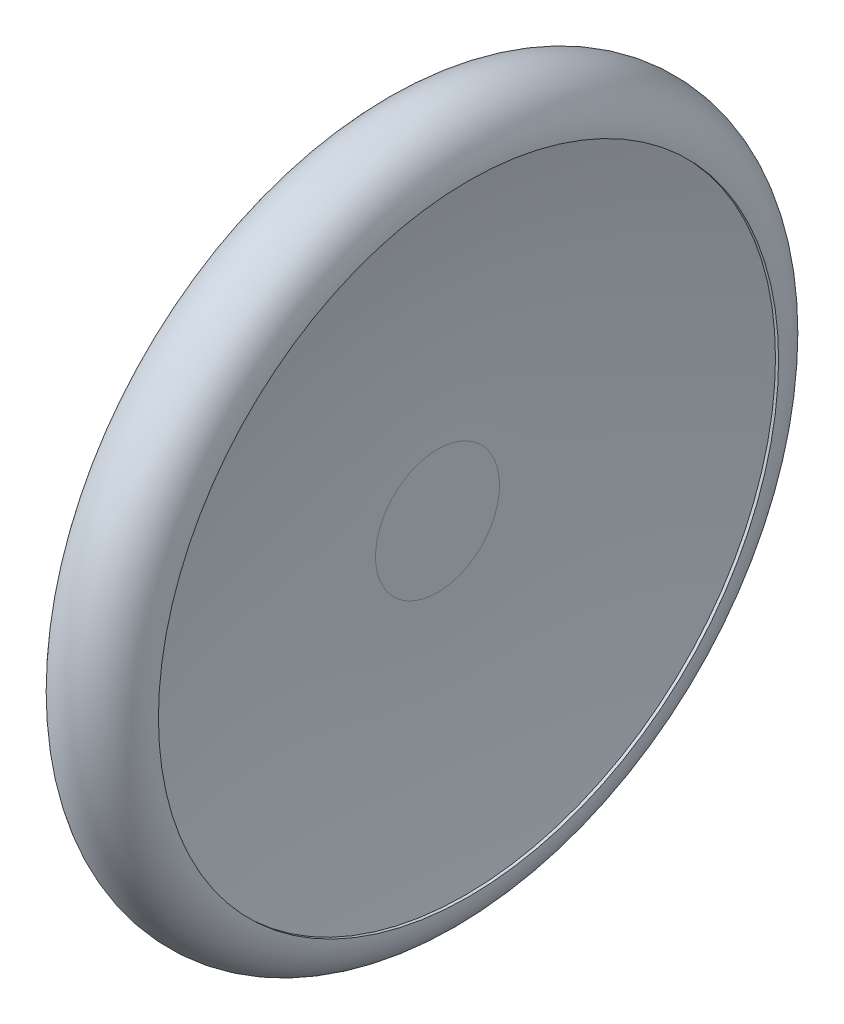
ISO-10303-21;
HEADER;
FILE_DESCRIPTION(('STEP AP214'),'2;1');
FILE_NAME('part.step','',(''),(''),'','','');
FILE_SCHEMA(('AUTOMOTIVE_DESIGN { 1 0 10303 214 1 1 1 1 }'));
ENDSEC;
DATA;
#1=APPLICATION_CONTEXT('core data for automotive mechanical design processes');
#2=APPLICATION_PROTOCOL_DEFINITION('international standard','automotive_design',2000,#1);
#3=PRODUCT_CONTEXT('',#1,'mechanical');
#4=PRODUCT('Part','Part','',(#3));
#5=PRODUCT_RELATED_PRODUCT_CATEGORY('part','',(#4));
#6=PRODUCT_DEFINITION_FORMATION('','',#4);
#7=PRODUCT_DEFINITION_CONTEXT('part definition',#1,'design');
#8=PRODUCT_DEFINITION('design','',#6,#7);
#9=PRODUCT_DEFINITION_SHAPE('','',#8);
#10=(LENGTH_UNIT() NAMED_UNIT(*) SI_UNIT(.MILLI.,.METRE.));
#11=(NAMED_UNIT(*) PLANE_ANGLE_UNIT() SI_UNIT($,.RADIAN.));
#12=(NAMED_UNIT(*) SI_UNIT($,.STERADIAN.) SOLID_ANGLE_UNIT());
#13=UNCERTAINTY_MEASURE_WITH_UNIT(LENGTH_MEASURE(1.E-05),#10,'distance_accuracy_value','');
#14=(GEOMETRIC_REPRESENTATION_CONTEXT(3) GLOBAL_UNCERTAINTY_ASSIGNED_CONTEXT((#13)) GLOBAL_UNIT_ASSIGNED_CONTEXT((#10,
#11,#12)) REPRESENTATION_CONTEXT('',''));
#15=CARTESIAN_POINT('',(0.,0.,0.));
#16=DIRECTION('',(0.,0.,1.));
#17=DIRECTION('',(1.,0.,0.));
#18=AXIS2_PLACEMENT_3D('',#15,#16,#17);
#19=CARTESIAN_POINT('',(-5.,0.,0.));
#20=DIRECTION('',(1.,0.,0.));
#21=DIRECTION('',(0.,0.,-1.));
#22=AXIS2_PLACEMENT_3D('',#19,#20,#21);
#23=PLANE('',#22);
#24=CARTESIAN_POINT('',(-5.,0.,0.));
#25=DIRECTION('',(1.,0.,0.));
#26=DIRECTION('',(0.,0.,-1.));
#27=AXIS2_PLACEMENT_3D('',#24,#25,#26);
#28=CIRCLE('',#27,10.);
#29=CARTESIAN_POINT('',(-5.,0.,-10.));
#30=VERTEX_POINT('',#29);
#31=EDGE_CURVE('E10',#30,#30,#28,.F.);
#32=ORIENTED_EDGE('',*,*,#31,.F.);
#33=EDGE_LOOP('',(#32));
#34=FACE_BOUND('',#33,.T.);
#35=CARTESIAN_POINT('',(-5.,0.,0.));
#36=DIRECTION('',(-1.,0.,0.));
#37=DIRECTION('',(0.,0.,1.));
#38=AXIS2_PLACEMENT_3D('',#35,#36,#37);
#39=CIRCLE('',#38,50.);
#40=CARTESIAN_POINT('',(-5.,0.,50.));
#41=VERTEX_POINT('',#40);
#42=EDGE_CURVE('E57',#41,#41,#39,.T.);
#43=ORIENTED_EDGE('',*,*,#42,.T.);
#44=EDGE_LOOP('',(#43));
#45=FACE_BOUND('',#44,.T.);
#46=ADVANCED_FACE('F38',(#34,#45),#23,.F.);
#47=CARTESIAN_POINT('',(5.,0.,0.));
#48=DIRECTION('',(-1.,0.,0.));
#49=DIRECTION('',(0.,0.,1.));
#50=AXIS2_PLACEMENT_3D('',#47,#48,#49);
#51=PLANE('',#50);
#52=CARTESIAN_POINT('',(5.,0.,0.));
#53=DIRECTION('',(-1.,0.,0.));
#54=DIRECTION('',(0.,0.,1.));
#55=AXIS2_PLACEMENT_3D('',#52,#53,#54);
#56=CIRCLE('',#55,10.);
#57=CARTESIAN_POINT('',(5.,0.,10.));
#58=VERTEX_POINT('',#57);
#59=EDGE_CURVE('E44',#58,#58,#56,.T.);
#60=ORIENTED_EDGE('',*,*,#59,.F.);
#61=EDGE_LOOP('',(#60));
#62=FACE_BOUND('',#61,.T.);
#63=ADVANCED_FACE('F79',(#62),#51,.F.);
#64=CARTESIAN_POINT('',(185.027777777778,0.,0.));
#65=DIRECTION('',(-1.,0.,0.));
#66=DIRECTION('',(0.,0.,1.));
#67=AXIS2_PLACEMENT_3D('',#64,#65,#66);
#68=DEGENERATE_TOROIDAL_SURFACE('',#67,10.,180.027777777778,.T.);
#69=CARTESIAN_POINT('',(9.5,0.,0.));
#70=DIRECTION('',(-1.,0.,0.));
#71=DIRECTION('',(0.,0.,1.));
#72=AXIS2_PLACEMENT_3D('',#69,#70,#71);
#73=CIRCLE('',#72,50.);
#74=CARTESIAN_POINT('',(9.5,0.,50.));
#75=VERTEX_POINT('',#74);
#76=EDGE_CURVE('E48',#75,#75,#73,.T.);
#77=ORIENTED_EDGE('',*,*,#76,.F.);
#78=EDGE_LOOP('',(#77));
#79=FACE_BOUND('',#78,.T.);
#80=ORIENTED_EDGE('',*,*,#59,.T.);
#81=EDGE_LOOP('',(#80));
#82=FACE_BOUND('',#81,.T.);
#83=ADVANCED_FACE('F84',(#79,#82),#68,.F.);
#84=CARTESIAN_POINT('',(-5.,0.,0.));
#85=DIRECTION('',(-1.,0.,0.));
#86=DIRECTION('',(0.,0.,1.));
#87=AXIS2_PLACEMENT_3D('',#84,#85,#86);
#88=CYLINDRICAL_SURFACE('',#87,50.);
#89=CARTESIAN_POINT('',(10.,0.,0.));
#90=DIRECTION('',(-1.,0.,0.));
#91=DIRECTION('',(0.,0.,1.));
#92=AXIS2_PLACEMENT_3D('',#89,#90,#91);
#93=CIRCLE('',#92,50.);
#94=CARTESIAN_POINT('',(10.,0.,50.));
#95=VERTEX_POINT('',#94);
#96=EDGE_CURVE('E52',#95,#95,#93,.T.);
#97=ORIENTED_EDGE('',*,*,#96,.F.);
#98=EDGE_LOOP('',(#97));
#99=FACE_BOUND('',#98,.T.);
#100=ORIENTED_EDGE('',*,*,#76,.T.);
#101=EDGE_LOOP('',(#100));
#102=FACE_BOUND('',#101,.T.);
#103=ADVANCED_FACE('F75',(#99,#102),#88,.F.);
#104=CARTESIAN_POINT('',(2.5,0.,0.));
#105=DIRECTION('',(-1.,0.,0.));
#106=DIRECTION('',(0.,0.,1.));
#107=AXIS2_PLACEMENT_3D('',#104,#105,#106);
#108=TOROIDAL_SURFACE('',#107,50.,7.5);
#109=ORIENTED_EDGE('',*,*,#42,.F.);
#110=EDGE_LOOP('',(#109));
#111=FACE_BOUND('',#110,.T.);
#112=ORIENTED_EDGE('',*,*,#96,.T.);
#113=EDGE_LOOP('',(#112));
#114=FACE_BOUND('',#113,.T.);
#115=ADVANCED_FACE('F68',(#111,#114),#108,.T.);
#116=CARTESIAN_POINT('',(-15.,0.,0.));
#117=DIRECTION('',(1.,0.,0.));
#118=DIRECTION('',(0.,0.,-1.));
#119=AXIS2_PLACEMENT_3D('',#116,#117,#118);
#120=CYLINDRICAL_SURFACE('',#119,10.);
#121=CARTESIAN_POINT('',(-15.,0.,0.));
#122=DIRECTION('',(-1.,0.,0.));
#123=DIRECTION('',(0.,0.,1.));
#124=AXIS2_PLACEMENT_3D('',#121,#122,#123);
#125=CIRCLE('',#124,10.);
#126=CARTESIAN_POINT('',(-15.,0.,10.));
#127=VERTEX_POINT('',#126);
#128=EDGE_CURVE('E60',#127,#127,#125,.T.);
#129=ORIENTED_EDGE('',*,*,#128,.F.);
#130=EDGE_LOOP('',(#129));
#131=FACE_BOUND('',#130,.T.);
#132=ORIENTED_EDGE('',*,*,#31,.T.);
#133=EDGE_LOOP('',(#132));
#134=FACE_BOUND('',#133,.T.);
#135=ADVANCED_FACE('F66',(#131,#134),#120,.T.);
#136=CARTESIAN_POINT('',(-15.,0.,0.));
#137=DIRECTION('',(-1.,0.,0.));
#138=DIRECTION('',(0.,0.,1.));
#139=AXIS2_PLACEMENT_3D('',#136,#137,#138);
#140=PLANE('',#139);
#141=ORIENTED_EDGE('',*,*,#128,.T.);
#142=EDGE_LOOP('',(#141));
#143=FACE_BOUND('',#142,.T.);
#144=ADVANCED_FACE('F64',(#143),#140,.T.);
#145=CLOSED_SHELL('',(#46,#63,#83,#103,#115,#135,#144));
#146=MANIFOLD_SOLID_BREP('B2',#145);
#147=ADVANCED_BREP_SHAPE_REPRESENTATION('',(#18,#146),#14);
#148=SHAPE_DEFINITION_REPRESENTATION(#9,#147);
ENDSEC;
END-ISO-10303-21;
